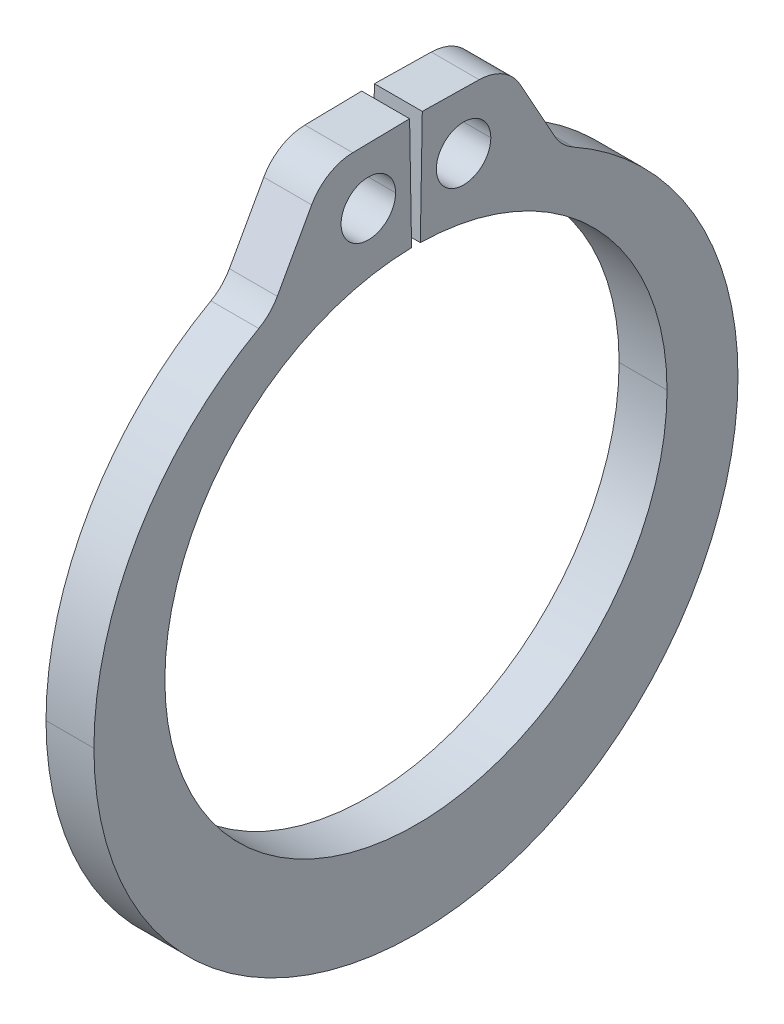
ISO-10303-21;
HEADER;
FILE_DESCRIPTION(('STEP AP214'),'2;1');
FILE_NAME('part.step','',(''),(''),'','','');
FILE_SCHEMA(('AUTOMOTIVE_DESIGN { 1 0 10303 214 1 1 1 1 }'));
ENDSEC;
DATA;
#1=APPLICATION_CONTEXT('core data for automotive mechanical design processes');
#2=APPLICATION_PROTOCOL_DEFINITION('international standard','automotive_design',2000,#1);
#3=PRODUCT_CONTEXT('',#1,'mechanical');
#4=PRODUCT('Part','Part','',(#3));
#5=PRODUCT_RELATED_PRODUCT_CATEGORY('part','',(#4));
#6=PRODUCT_DEFINITION_FORMATION('','',#4);
#7=PRODUCT_DEFINITION_CONTEXT('part definition',#1,'design');
#8=PRODUCT_DEFINITION('design','',#6,#7);
#9=PRODUCT_DEFINITION_SHAPE('','',#8);
#10=(LENGTH_UNIT() NAMED_UNIT(*) SI_UNIT(.MILLI.,.METRE.));
#11=(NAMED_UNIT(*) PLANE_ANGLE_UNIT() SI_UNIT($,.RADIAN.));
#12=(NAMED_UNIT(*) SI_UNIT($,.STERADIAN.) SOLID_ANGLE_UNIT());
#13=UNCERTAINTY_MEASURE_WITH_UNIT(LENGTH_MEASURE(1.E-05),#10,'distance_accuracy_value','');
#14=(GEOMETRIC_REPRESENTATION_CONTEXT(3) GLOBAL_UNCERTAINTY_ASSIGNED_CONTEXT((#13)) GLOBAL_UNIT_ASSIGNED_CONTEXT((#10,
#11,#12)) REPRESENTATION_CONTEXT('',''));
#15=CARTESIAN_POINT('',(0.,0.,0.));
#16=DIRECTION('',(0.,0.,1.));
#17=DIRECTION('',(1.,0.,0.));
#18=AXIS2_PLACEMENT_3D('',#15,#16,#17);
#19=CARTESIAN_POINT('',(0.97155,12.7720810042562,-2.53055334817983));
#20=DIRECTION('',(-1.,0.,0.));
#21=DIRECTION('',(0.,0.,1.));
#22=AXIS2_PLACEMENT_3D('',#19,#20,#21);
#23=CYLINDRICAL_SURFACE('',#22,1.9431);
#24=CARTESIAN_POINT('',(0.97155,12.7720810042562,-2.53055334817983));
#25=DIRECTION('',(1.,0.,0.));
#26=DIRECTION('',(0.,0.,-1.));
#27=AXIS2_PLACEMENT_3D('',#24,#25,#26);
#28=CIRCLE('',#27,1.9431);
#29=CARTESIAN_POINT('',(0.97155,13.7142637333689,-4.22994421403788));
#30=VERTEX_POINT('',#29);
#31=CARTESIAN_POINT('',(0.97155,14.7148850607146,-2.56446511912812));
#32=VERTEX_POINT('',#31);
#33=EDGE_CURVE('E279',#30,#32,#28,.T.);
#34=ORIENTED_EDGE('',*,*,#33,.F.);
#35=DIRECTION('',(1.,0.,0.));
#36=VECTOR('',#35,1.);
#37=CARTESIAN_POINT('',(0.97155,13.7142637333689,-4.22994421403788));
#38=LINE('',#37,#36);
#39=CARTESIAN_POINT('',(-0.97155,13.7142637333689,-4.22994421403788));
#40=VERTEX_POINT('',#39);
#41=EDGE_CURVE('E154',#40,#30,#38,.T.);
#42=ORIENTED_EDGE('',*,*,#41,.F.);
#43=CARTESIAN_POINT('',(-0.97155,12.7720810042562,-2.53055334817983));
#44=DIRECTION('',(-1.,0.,0.));
#45=DIRECTION('',(0.,0.,-1.));
#46=AXIS2_PLACEMENT_3D('',#43,#44,#45);
#47=CIRCLE('',#46,1.9431);
#48=CARTESIAN_POINT('',(-0.97155,14.7148850607146,-2.56446511912812));
#49=VERTEX_POINT('',#48);
#50=EDGE_CURVE('E300',#49,#40,#47,.T.);
#51=ORIENTED_EDGE('',*,*,#50,.F.);
#52=DIRECTION('',(-1.,0.,0.));
#53=VECTOR('',#52,1.);
#54=CARTESIAN_POINT('',(0.97155,14.7148850607146,-2.56446511912812));
#55=LINE('',#54,#53);
#56=EDGE_CURVE('E27',#32,#49,#55,.T.);
#57=ORIENTED_EDGE('',*,*,#56,.F.);
#58=EDGE_LOOP('',(#34,#42,#51,#57));
#59=FACE_BOUND('',#58,.T.);
#60=ADVANCED_FACE('F16',(#59),#23,.T.);
#61=CARTESIAN_POINT('',(0.97155,12.7720810042562,2.53055334817983));
#62=DIRECTION('',(-1.,0.,0.));
#63=DIRECTION('',(0.,0.,1.));
#64=AXIS2_PLACEMENT_3D('',#61,#62,#63);
#65=CYLINDRICAL_SURFACE('',#64,1.9431);
#66=CARTESIAN_POINT('',(0.97155,12.7720810042562,2.53055334817983));
#67=DIRECTION('',(1.,0.,0.));
#68=DIRECTION('',(0.,0.,-1.));
#69=AXIS2_PLACEMENT_3D('',#66,#67,#68);
#70=CIRCLE('',#69,1.9431);
#71=CARTESIAN_POINT('',(0.97155,14.7148850607146,2.56446511912812));
#72=VERTEX_POINT('',#71);
#73=CARTESIAN_POINT('',(0.97155,13.7142637333689,4.22994421403788));
#74=VERTEX_POINT('',#73);
#75=EDGE_CURVE('E20',#72,#74,#70,.T.);
#76=ORIENTED_EDGE('',*,*,#75,.F.);
#77=DIRECTION('',(1.,0.,0.));
#78=VECTOR('',#77,1.);
#79=CARTESIAN_POINT('',(0.97155,14.7148850607146,2.56446511912812));
#80=LINE('',#79,#78);
#81=CARTESIAN_POINT('',(-0.97155,14.7148850607146,2.56446511912812));
#82=VERTEX_POINT('',#81);
#83=EDGE_CURVE('E306',#82,#72,#80,.T.);
#84=ORIENTED_EDGE('',*,*,#83,.F.);
#85=CARTESIAN_POINT('',(-0.97155,12.7720810042562,2.53055334817983));
#86=DIRECTION('',(-1.,0.,0.));
#87=DIRECTION('',(0.,0.,-1.));
#88=AXIS2_PLACEMENT_3D('',#85,#86,#87);
#89=CIRCLE('',#88,1.9431);
#90=CARTESIAN_POINT('',(-0.97155,13.7142637333689,4.22994421403788));
#91=VERTEX_POINT('',#90);
#92=EDGE_CURVE('E261',#91,#82,#89,.T.);
#93=ORIENTED_EDGE('',*,*,#92,.F.);
#94=DIRECTION('',(-1.,0.,0.));
#95=VECTOR('',#94,1.);
#96=CARTESIAN_POINT('',(0.97155,13.7142637333689,4.22994421403788));
#97=LINE('',#96,#95);
#98=EDGE_CURVE('E305',#74,#91,#97,.T.);
#99=ORIENTED_EDGE('',*,*,#98,.F.);
#100=EDGE_LOOP('',(#76,#84,#93,#99));
#101=FACE_BOUND('',#100,.T.);
#102=ADVANCED_FACE('F446',(#101),#65,.T.);
#103=CARTESIAN_POINT('',(0.97155,12.1409614113131,-7.32397984242115));
#104=DIRECTION('',(-1.,0.,0.));
#105=DIRECTION('',(0.,0.,1.));
#106=AXIS2_PLACEMENT_3D('',#103,#104,#105);
#107=CYLINDRICAL_SURFACE('',#106,1.9431);
#108=CARTESIAN_POINT('',(0.97155,12.1409614113131,-7.32397984242115));
#109=DIRECTION('',(-1.,0.,0.));
#110=DIRECTION('',(0.,0.,-1.));
#111=AXIS2_PLACEMENT_3D('',#108,#109,#110);
#112=CIRCLE('',#111,1.9431);
#113=CARTESIAN_POINT('',(0.97155,10.4449894530748,-6.37565672930559));
#114=VERTEX_POINT('',#113);
#115=CARTESIAN_POINT('',(0.97155,11.1987786822004,-5.6245889765631));
#116=VERTEX_POINT('',#115);
#117=EDGE_CURVE('E372',#114,#116,#112,.T.);
#118=ORIENTED_EDGE('',*,*,#117,.F.);
#119=DIRECTION('',(1.,0.,0.));
#120=VECTOR('',#119,1.);
#121=CARTESIAN_POINT('',(0.97155,10.4449894530748,-6.37565672930559));
#122=LINE('',#121,#120);
#123=CARTESIAN_POINT('',(-0.97155,10.4449894530748,-6.37565672930559));
#124=VERTEX_POINT('',#123);
#125=EDGE_CURVE('E278',#124,#114,#122,.T.);
#126=ORIENTED_EDGE('',*,*,#125,.F.);
#127=CARTESIAN_POINT('',(-0.97155,12.1409614113131,-7.32397984242115));
#128=DIRECTION('',(1.,0.,0.));
#129=DIRECTION('',(0.,0.,-1.));
#130=AXIS2_PLACEMENT_3D('',#127,#128,#129);
#131=CIRCLE('',#130,1.9431);
#132=CARTESIAN_POINT('',(-0.97155,11.1987786822004,-5.6245889765631));
#133=VERTEX_POINT('',#132);
#134=EDGE_CURVE('E299',#133,#124,#131,.T.);
#135=ORIENTED_EDGE('',*,*,#134,.F.);
#136=DIRECTION('',(-1.,0.,0.));
#137=VECTOR('',#136,1.);
#138=CARTESIAN_POINT('',(-0.97155,11.1987786822004,-5.6245889765631));
#139=LINE('',#138,#137);
#140=EDGE_CURVE('E310',#116,#133,#139,.T.);
#141=ORIENTED_EDGE('',*,*,#140,.F.);
#142=EDGE_LOOP('',(#118,#126,#135,#141));
#143=FACE_BOUND('',#142,.T.);
#144=ADVANCED_FACE('F502',(#143),#107,.F.);
#145=CARTESIAN_POINT('',(0.97155,12.1409614113131,7.32397984242115));
#146=DIRECTION('',(-1.,0.,0.));
#147=DIRECTION('',(0.,0.,1.));
#148=AXIS2_PLACEMENT_3D('',#145,#146,#147);
#149=CYLINDRICAL_SURFACE('',#148,1.9431);
#150=CARTESIAN_POINT('',(0.97155,12.1409614113131,7.32397984242115));
#151=DIRECTION('',(-1.,0.,0.));
#152=DIRECTION('',(0.,0.,-1.));
#153=AXIS2_PLACEMENT_3D('',#150,#151,#152);
#154=CIRCLE('',#153,1.9431);
#155=CARTESIAN_POINT('',(0.97155,11.1987786822004,5.6245889765631));
#156=VERTEX_POINT('',#155);
#157=CARTESIAN_POINT('',(0.97155,10.4449894530748,6.37565672930559));
#158=VERTEX_POINT('',#157);
#159=EDGE_CURVE('E323',#156,#158,#154,.T.);
#160=ORIENTED_EDGE('',*,*,#159,.F.);
#161=DIRECTION('',(1.,0.,0.));
#162=VECTOR('',#161,1.);
#163=CARTESIAN_POINT('',(0.97155,11.1987786822004,5.6245889765631));
#164=LINE('',#163,#162);
#165=CARTESIAN_POINT('',(-0.97155,11.1987786822004,5.6245889765631));
#166=VERTEX_POINT('',#165);
#167=EDGE_CURVE('E302',#166,#156,#164,.T.);
#168=ORIENTED_EDGE('',*,*,#167,.F.);
#169=CARTESIAN_POINT('',(-0.97155,12.1409614113131,7.32397984242115));
#170=DIRECTION('',(1.,0.,0.));
#171=DIRECTION('',(0.,0.,-1.));
#172=AXIS2_PLACEMENT_3D('',#169,#170,#171);
#173=CIRCLE('',#172,1.9431);
#174=CARTESIAN_POINT('',(-0.97155,10.4449894530748,6.37565672930559));
#175=VERTEX_POINT('',#174);
#176=EDGE_CURVE('E351',#175,#166,#173,.T.);
#177=ORIENTED_EDGE('',*,*,#176,.F.);
#178=DIRECTION('',(-1.,0.,0.));
#179=VECTOR('',#178,1.);
#180=CARTESIAN_POINT('',(0.97155,10.4449894530748,6.37565672930559));
#181=LINE('',#180,#179);
#182=EDGE_CURVE('E42',#158,#175,#181,.T.);
#183=ORIENTED_EDGE('',*,*,#182,.F.);
#184=EDGE_LOOP('',(#160,#168,#177,#183));
#185=FACE_BOUND('',#184,.T.);
#186=ADVANCED_FACE('F524',(#185),#149,.F.);
#187=CARTESIAN_POINT('',(0.97155,12.4395783945367,-1.93189481498757));
#188=DIRECTION('',(-1.,0.,0.));
#189=DIRECTION('',(0.,0.,1.));
#190=AXIS2_PLACEMENT_3D('',#187,#188,#189);
#191=CYLINDRICAL_SURFACE('',#190,1.1049);
#192=DIRECTION('',(-1.,0.,0.));
#193=VECTOR('',#192,1.);
#194=CARTESIAN_POINT('',(0.97155,12.4395783945367,-3.03679481498757));
#195=LINE('',#194,#193);
#196=CARTESIAN_POINT('',(0.97155,12.4395783945367,-3.03679481498757));
#197=VERTEX_POINT('',#196);
#198=CARTESIAN_POINT('',(-0.97155,12.4395783945367,-3.03679481498757));
#199=VERTEX_POINT('',#198);
#200=EDGE_CURVE('E245',#197,#199,#195,.T.);
#201=ORIENTED_EDGE('',*,*,#200,.F.);
#202=CARTESIAN_POINT('',(0.97155,12.4395783945367,-1.93189481498757));
#203=DIRECTION('',(1.,0.,0.));
#204=DIRECTION('',(0.,0.,-1.));
#205=AXIS2_PLACEMENT_3D('',#202,#203,#204);
#206=CIRCLE('',#205,1.1049);
#207=CARTESIAN_POINT('',(0.97155,12.4395783945367,-0.826994814987568));
#208=VERTEX_POINT('',#207);
#209=EDGE_CURVE('E287',#197,#208,#206,.T.);
#210=ORIENTED_EDGE('',*,*,#209,.T.);
#211=DIRECTION('',(-1.,0.,0.));
#212=VECTOR('',#211,1.);
#213=CARTESIAN_POINT('',(0.97155,12.4395783945367,-0.826994814987568));
#214=LINE('',#213,#212);
#215=CARTESIAN_POINT('',(-0.97155,12.4395783945367,-0.826994814987568));
#216=VERTEX_POINT('',#215);
#217=EDGE_CURVE('E249',#208,#216,#214,.T.);
#218=ORIENTED_EDGE('',*,*,#217,.T.);
#219=CARTESIAN_POINT('',(-0.97155,12.4395783945367,-1.93189481498757));
#220=DIRECTION('',(1.,0.,0.));
#221=DIRECTION('',(0.,0.,-1.));
#222=AXIS2_PLACEMENT_3D('',#219,#220,#221);
#223=CIRCLE('',#222,1.1049);
#224=EDGE_CURVE('E325',#199,#216,#223,.T.);
#225=ORIENTED_EDGE('',*,*,#224,.F.);
#226=EDGE_LOOP('',(#201,#210,#218,#225));
#227=FACE_BOUND('',#226,.T.);
#228=ADVANCED_FACE('F474',(#227),#191,.F.);
#229=CARTESIAN_POINT('',(0.97155,12.4395783945367,1.93189481498757));
#230=DIRECTION('',(-1.,0.,0.));
#231=DIRECTION('',(0.,0.,1.));
#232=AXIS2_PLACEMENT_3D('',#229,#230,#231);
#233=CYLINDRICAL_SURFACE('',#232,1.1049);
#234=DIRECTION('',(-1.,0.,0.));
#235=VECTOR('',#234,1.);
#236=CARTESIAN_POINT('',(0.97155,12.4395783945367,0.826994814987568));
#237=LINE('',#236,#235);
#238=CARTESIAN_POINT('',(0.97155,12.4395783945367,0.826994814987568));
#239=VERTEX_POINT('',#238);
#240=CARTESIAN_POINT('',(-0.97155,12.4395783945367,0.826994814987568));
#241=VERTEX_POINT('',#240);
#242=EDGE_CURVE('E293',#239,#241,#237,.T.);
#243=ORIENTED_EDGE('',*,*,#242,.F.);
#244=CARTESIAN_POINT('',(0.97155,12.4395783945367,1.93189481498757));
#245=DIRECTION('',(1.,0.,0.));
#246=DIRECTION('',(0.,0.,-1.));
#247=AXIS2_PLACEMENT_3D('',#244,#245,#246);
#248=CIRCLE('',#247,1.1049);
#249=CARTESIAN_POINT('',(0.97155,12.4395783945367,3.03679481498757));
#250=VERTEX_POINT('',#249);
#251=EDGE_CURVE('E313',#239,#250,#248,.T.);
#252=ORIENTED_EDGE('',*,*,#251,.T.);
#253=DIRECTION('',(-1.,0.,0.));
#254=VECTOR('',#253,1.);
#255=CARTESIAN_POINT('',(0.97155,12.4395783945367,3.03679481498757));
#256=LINE('',#255,#254);
#257=CARTESIAN_POINT('',(-0.97155,12.4395783945367,3.03679481498757));
#258=VERTEX_POINT('',#257);
#259=EDGE_CURVE('E292',#250,#258,#256,.T.);
#260=ORIENTED_EDGE('',*,*,#259,.T.);
#261=CARTESIAN_POINT('',(-0.97155,12.4395783945367,1.93189481498757));
#262=DIRECTION('',(1.,0.,0.));
#263=DIRECTION('',(0.,0.,-1.));
#264=AXIS2_PLACEMENT_3D('',#261,#262,#263);
#265=CIRCLE('',#264,1.1049);
#266=EDGE_CURVE('E329',#241,#258,#265,.T.);
#267=ORIENTED_EDGE('',*,*,#266,.F.);
#268=EDGE_LOOP('',(#243,#252,#260,#267));
#269=FACE_BOUND('',#268,.T.);
#270=ADVANCED_FACE('F490',(#269),#233,.F.);
#271=CARTESIAN_POINT('',(0.97155,10.1838487142459,-0.177759740526307));
#272=DIRECTION('',(0.,-0.0174524064372833,-0.999847695156391));
#273=DIRECTION('',(0.,-0.999847695156391,0.0174524064372833));
#274=AXIS2_PLACEMENT_3D('',#271,#272,#273);
#275=PLANE('',#274);
#276=DIRECTION('',(0.,-0.999847695156391,0.0174524064372833));
#277=VECTOR('',#276,1.);
#278=CARTESIAN_POINT('',(-0.97155,10.1838487142459,-0.177759740526307));
#279=LINE('',#278,#277);
#280=CARTESIAN_POINT('',(-0.97155,14.7551523765009,-0.257552142757566));
#281=VERTEX_POINT('',#280);
#282=CARTESIAN_POINT('',(-0.97155,10.1838487142459,-0.177759740526307));
#283=VERTEX_POINT('',#282);
#284=EDGE_CURVE('E270',#281,#283,#279,.T.);
#285=ORIENTED_EDGE('',*,*,#284,.T.);
#286=DIRECTION('',(-1.,0.,0.));
#287=VECTOR('',#286,1.);
#288=CARTESIAN_POINT('',(0.97155,10.1838487142459,-0.177759740526307));
#289=LINE('',#288,#287);
#290=CARTESIAN_POINT('',(0.97155,10.1838487142459,-0.177759740526307));
#291=VERTEX_POINT('',#290);
#292=EDGE_CURVE('E328',#291,#283,#289,.T.);
#293=ORIENTED_EDGE('',*,*,#292,.F.);
#294=DIRECTION('',(0.,-0.999847695156391,0.0174524064372833));
#295=VECTOR('',#294,1.);
#296=CARTESIAN_POINT('',(0.97155,10.1838487142459,-0.177759740526307));
#297=LINE('',#296,#295);
#298=CARTESIAN_POINT('',(0.97155,14.7551523765009,-0.257552142757566));
#299=VERTEX_POINT('',#298);
#300=EDGE_CURVE('E253',#299,#291,#297,.T.);
#301=ORIENTED_EDGE('',*,*,#300,.F.);
#302=DIRECTION('',(-1.,0.,0.));
#303=VECTOR('',#302,1.);
#304=CARTESIAN_POINT('',(0.97155,14.7551523765009,-0.257552142757566));
#305=LINE('',#304,#303);
#306=EDGE_CURVE('E11',#299,#281,#305,.T.);
#307=ORIENTED_EDGE('',*,*,#306,.T.);
#308=EDGE_LOOP('',(#285,#293,#301,#307));
#309=FACE_BOUND('',#308,.T.);
#310=ADVANCED_FACE('F523',(#309),#275,.F.);
#311=CARTESIAN_POINT('',(0.97155,14.7551523765009,-0.257552142757566));
#312=DIRECTION('',(0.,-0.999847695156391,0.0174524064372834));
#313=DIRECTION('',(-1.,0.,0.));
#314=AXIS2_PLACEMENT_3D('',#311,#312,#313);
#315=PLANE('',#314);
#316=DIRECTION('',(0.,0.0174524064372834,0.999847695156391));
#317=VECTOR('',#316,1.);
#318=CARTESIAN_POINT('',(0.97155,14.7551523765009,-0.257552142757566));
#319=LINE('',#318,#317);
#320=EDGE_CURVE('E258',#32,#299,#319,.T.);
#321=ORIENTED_EDGE('',*,*,#320,.F.);
#322=ORIENTED_EDGE('',*,*,#56,.T.);
#323=DIRECTION('',(0.,0.0174524064372834,0.999847695156391));
#324=VECTOR('',#323,1.);
#325=CARTESIAN_POINT('',(-0.97155,14.7551523765009,-0.257552142757566));
#326=LINE('',#325,#324);
#327=EDGE_CURVE('E274',#49,#281,#326,.T.);
#328=ORIENTED_EDGE('',*,*,#327,.T.);
#329=ORIENTED_EDGE('',*,*,#306,.F.);
#330=EDGE_LOOP('',(#321,#322,#328,#329));
#331=FACE_BOUND('',#330,.T.);
#332=ADVANCED_FACE('F418',(#331),#315,.F.);
#333=CARTESIAN_POINT('',(0.97155,14.6953080748275,-3.68602988944883));
#334=DIRECTION('',(0.,-0.484886382127883,0.874577152929879));
#335=DIRECTION('',(-1.,0.,0.));
#336=AXIS2_PLACEMENT_3D('',#333,#334,#335);
#337=PLANE('',#336);
#338=DIRECTION('',(0.,0.874577152929879,0.484886382127883));
#339=VECTOR('',#338,1.);
#340=CARTESIAN_POINT('',(0.97155,14.6953080748275,-3.68602988944883));
#341=LINE('',#340,#339);
#342=EDGE_CURVE('E283',#116,#30,#341,.T.);
#343=ORIENTED_EDGE('',*,*,#342,.F.);
#344=ORIENTED_EDGE('',*,*,#140,.T.);
#345=DIRECTION('',(0.,0.874577152929879,0.484886382127883));
#346=VECTOR('',#345,1.);
#347=CARTESIAN_POINT('',(-0.97155,14.6953080748275,-3.68602988944883));
#348=LINE('',#347,#346);
#349=EDGE_CURVE('E297',#133,#40,#348,.T.);
#350=ORIENTED_EDGE('',*,*,#349,.T.);
#351=ORIENTED_EDGE('',*,*,#41,.T.);
#352=EDGE_LOOP('',(#343,#344,#350,#351));
#353=FACE_BOUND('',#352,.T.);
#354=ADVANCED_FACE('F422',(#353),#337,.F.);
#355=CARTESIAN_POINT('',(0.97155,-0.957173879981445,0.));
#356=DIRECTION('',(-1.,0.,0.));
#357=DIRECTION('',(0.,0.,1.));
#358=AXIS2_PLACEMENT_3D('',#355,#356,#357);
#359=CYLINDRICAL_SURFACE('',#358,13.0636261200186);
#360=DIRECTION('',(-1.,0.,0.));
#361=VECTOR('',#360,1.);
#362=CARTESIAN_POINT('',(0.97155,-0.957173879981445,13.0636261200186));
#363=LINE('',#362,#361);
#364=CARTESIAN_POINT('',(0.97155,-0.957173879981445,13.0636261200186));
#365=VERTEX_POINT('',#364);
#366=CARTESIAN_POINT('',(-0.97155,-0.957173879981445,13.0636261200186));
#367=VERTEX_POINT('',#366);
#368=EDGE_CURVE('E240',#365,#367,#363,.T.);
#369=ORIENTED_EDGE('',*,*,#368,.F.);
#370=CARTESIAN_POINT('',(0.97155,-0.957173879981445,0.));
#371=DIRECTION('',(1.,0.,0.));
#372=DIRECTION('',(0.,0.,-1.));
#373=AXIS2_PLACEMENT_3D('',#370,#371,#372);
#374=CIRCLE('',#373,13.0636261200186);
#375=EDGE_CURVE('E341',#158,#365,#374,.T.);
#376=ORIENTED_EDGE('',*,*,#375,.F.);
#377=ORIENTED_EDGE('',*,*,#182,.T.);
#378=CARTESIAN_POINT('',(-0.97155,-0.957173879981445,0.));
#379=DIRECTION('',(1.,0.,0.));
#380=DIRECTION('',(0.,0.,-1.));
#381=AXIS2_PLACEMENT_3D('',#378,#379,#380);
#382=CIRCLE('',#381,13.0636261200186);
#383=EDGE_CURVE('E236',#175,#367,#382,.T.);
#384=ORIENTED_EDGE('',*,*,#383,.T.);
#385=EDGE_LOOP('',(#369,#376,#377,#384));
#386=FACE_BOUND('',#385,.T.);
#387=ADVANCED_FACE('F505',(#386),#359,.T.);
#388=CARTESIAN_POINT('',(0.97155,14.6953080748275,3.68602988944883));
#389=DIRECTION('',(0.,-0.484886382127883,-0.874577152929879));
#390=DIRECTION('',(0.,-0.874577152929879,0.484886382127883));
#391=AXIS2_PLACEMENT_3D('',#388,#389,#390);
#392=PLANE('',#391);
#393=DIRECTION('',(0.,-0.874577152929879,0.484886382127883));
#394=VECTOR('',#393,1.);
#395=CARTESIAN_POINT('',(-0.97155,14.6953080748275,3.68602988944883));
#396=LINE('',#395,#394);
#397=EDGE_CURVE('E266',#91,#166,#396,.T.);
#398=ORIENTED_EDGE('',*,*,#397,.T.);
#399=ORIENTED_EDGE('',*,*,#167,.T.);
#400=DIRECTION('',(0.,-0.874577152929879,0.484886382127883));
#401=VECTOR('',#400,1.);
#402=CARTESIAN_POINT('',(0.97155,14.6953080748275,3.68602988944883));
#403=LINE('',#402,#401);
#404=EDGE_CURVE('E320',#74,#156,#403,.T.);
#405=ORIENTED_EDGE('',*,*,#404,.F.);
#406=ORIENTED_EDGE('',*,*,#98,.T.);
#407=EDGE_LOOP('',(#398,#399,#405,#406));
#408=FACE_BOUND('',#407,.T.);
#409=ADVANCED_FACE('F510',(#408),#392,.F.);
#410=CARTESIAN_POINT('',(0.97155,14.7551523765009,0.257552142757566));
#411=DIRECTION('',(0.,-0.999847695156391,-0.0174524064372834));
#412=DIRECTION('',(0.,0.0174524064372834,-0.999847695156391));
#413=AXIS2_PLACEMENT_3D('',#410,#411,#412);
#414=PLANE('',#413);
#415=DIRECTION('',(0.,-0.0174524064372834,0.999847695156391));
#416=VECTOR('',#415,1.);
#417=CARTESIAN_POINT('',(-0.97155,14.7551523765009,0.257552142757566));
#418=LINE('',#417,#416);
#419=CARTESIAN_POINT('',(-0.97155,14.7551523765009,0.257552142757566));
#420=VERTEX_POINT('',#419);
#421=EDGE_CURVE('E265',#420,#82,#418,.T.);
#422=ORIENTED_EDGE('',*,*,#421,.T.);
#423=ORIENTED_EDGE('',*,*,#83,.T.);
#424=DIRECTION('',(0.,-0.0174524064372834,0.999847695156391));
#425=VECTOR('',#424,1.);
#426=CARTESIAN_POINT('',(0.97155,14.7551523765009,0.257552142757566));
#427=LINE('',#426,#425);
#428=CARTESIAN_POINT('',(0.97155,14.7551523765009,0.257552142757566));
#429=VERTEX_POINT('',#428);
#430=EDGE_CURVE('E359',#429,#72,#427,.T.);
#431=ORIENTED_EDGE('',*,*,#430,.F.);
#432=DIRECTION('',(-1.,0.,0.));
#433=VECTOR('',#432,1.);
#434=CARTESIAN_POINT('',(0.97155,14.7551523765009,0.257552142757566));
#435=LINE('',#434,#433);
#436=EDGE_CURVE('E335',#429,#420,#435,.T.);
#437=ORIENTED_EDGE('',*,*,#436,.T.);
#438=EDGE_LOOP('',(#422,#423,#431,#437));
#439=FACE_BOUND('',#438,.T.);
#440=ADVANCED_FACE('F440',(#439),#414,.F.);
#441=CARTESIAN_POINT('',(0.97155,10.1838487142459,0.177759740526307));
#442=DIRECTION('',(0.,-0.0174524064372833,0.999847695156391));
#443=DIRECTION('',(-1.,0.,0.));
#444=AXIS2_PLACEMENT_3D('',#441,#442,#443);
#445=PLANE('',#444);
#446=DIRECTION('',(0.,0.999847695156391,0.0174524064372833));
#447=VECTOR('',#446,1.);
#448=CARTESIAN_POINT('',(-0.97155,10.1838487142459,0.177759740526307));
#449=LINE('',#448,#447);
#450=CARTESIAN_POINT('',(-0.97155,10.1838487142459,0.177759740526307));
#451=VERTEX_POINT('',#450);
#452=EDGE_CURVE('E206',#451,#420,#449,.T.);
#453=ORIENTED_EDGE('',*,*,#452,.T.);
#454=ORIENTED_EDGE('',*,*,#436,.F.);
#455=DIRECTION('',(0.,0.999847695156391,0.0174524064372833));
#456=VECTOR('',#455,1.);
#457=CARTESIAN_POINT('',(0.97155,10.1838487142459,0.177759740526307));
#458=LINE('',#457,#456);
#459=CARTESIAN_POINT('',(0.97155,10.1838487142459,0.177759740526307));
#460=VERTEX_POINT('',#459);
#461=EDGE_CURVE('E186',#460,#429,#458,.T.);
#462=ORIENTED_EDGE('',*,*,#461,.F.);
#463=DIRECTION('',(-1.,0.,0.));
#464=VECTOR('',#463,1.);
#465=CARTESIAN_POINT('',(0.97155,10.1838487142459,0.177759740526307));
#466=LINE('',#465,#464);
#467=EDGE_CURVE('E209',#460,#451,#466,.T.);
#468=ORIENTED_EDGE('',*,*,#467,.T.);
#469=EDGE_LOOP('',(#453,#454,#462,#468));
#470=FACE_BOUND('',#469,.T.);
#471=ADVANCED_FACE('F509',(#470),#445,.F.);
#472=CARTESIAN_POINT('',(0.97155,0.,0.));
#473=DIRECTION('',(-1.,0.,0.));
#474=DIRECTION('',(0.,0.,1.));
#475=AXIS2_PLACEMENT_3D('',#472,#473,#474);
#476=CYLINDRICAL_SURFACE('',#475,10.1854);
#477=DIRECTION('',(-1.,0.,0.));
#478=VECTOR('',#477,1.);
#479=CARTESIAN_POINT('',(0.97155,0.,-10.1854));
#480=LINE('',#479,#478);
#481=CARTESIAN_POINT('',(0.97155,0.,-10.1854));
#482=VERTEX_POINT('',#481);
#483=CARTESIAN_POINT('',(-0.97155,0.,-10.1854));
#484=VERTEX_POINT('',#483);
#485=EDGE_CURVE('E224',#482,#484,#480,.T.);
#486=ORIENTED_EDGE('',*,*,#485,.F.);
#487=CARTESIAN_POINT('',(0.97155,0.,0.));
#488=DIRECTION('',(-1.,0.,0.));
#489=DIRECTION('',(0.,0.,-1.));
#490=AXIS2_PLACEMENT_3D('',#487,#488,#489);
#491=CIRCLE('',#490,10.1854);
#492=EDGE_CURVE('E257',#291,#482,#491,.T.);
#493=ORIENTED_EDGE('',*,*,#492,.F.);
#494=ORIENTED_EDGE('',*,*,#292,.T.);
#495=CARTESIAN_POINT('',(-0.97155,0.,0.));
#496=DIRECTION('',(-1.,0.,0.));
#497=DIRECTION('',(0.,0.,-1.));
#498=AXIS2_PLACEMENT_3D('',#495,#496,#497);
#499=CIRCLE('',#498,10.1854);
#500=EDGE_CURVE('E267',#283,#484,#499,.T.);
#501=ORIENTED_EDGE('',*,*,#500,.T.);
#502=EDGE_LOOP('',(#486,#493,#494,#501));
#503=FACE_BOUND('',#502,.T.);
#504=ADVANCED_FACE('F481',(#503),#476,.F.);
#505=CARTESIAN_POINT('',(-0.97155,0.,0.));
#506=DIRECTION('',(1.,0.,0.));
#507=DIRECTION('',(0.,1.,0.));
#508=AXIS2_PLACEMENT_3D('',#505,#506,#507);
#509=PLANE('',#508);
#510=CARTESIAN_POINT('',(-0.97155,12.4395783945367,-1.93189481498757));
#511=DIRECTION('',(1.,0.,0.));
#512=DIRECTION('',(0.,0.,-1.));
#513=AXIS2_PLACEMENT_3D('',#510,#511,#512);
#514=CIRCLE('',#513,1.1049);
#515=EDGE_CURVE('E246',#216,#199,#514,.T.);
#516=ORIENTED_EDGE('',*,*,#515,.T.);
#517=ORIENTED_EDGE('',*,*,#224,.T.);
#518=EDGE_LOOP('',(#516,#517));
#519=FACE_BOUND('',#518,.T.);
#520=CARTESIAN_POINT('',(-0.97155,12.4395783945367,1.93189481498757));
#521=DIRECTION('',(1.,0.,0.));
#522=DIRECTION('',(0.,0.,-1.));
#523=AXIS2_PLACEMENT_3D('',#520,#521,#522);
#524=CIRCLE('',#523,1.1049);
#525=EDGE_CURVE('E288',#258,#241,#524,.T.);
#526=ORIENTED_EDGE('',*,*,#525,.T.);
#527=ORIENTED_EDGE('',*,*,#266,.T.);
#528=EDGE_LOOP('',(#526,#527));
#529=FACE_BOUND('',#528,.T.);
#530=ORIENTED_EDGE('',*,*,#397,.F.);
#531=ORIENTED_EDGE('',*,*,#92,.T.);
#532=ORIENTED_EDGE('',*,*,#421,.F.);
#533=ORIENTED_EDGE('',*,*,#452,.F.);
#534=CARTESIAN_POINT('',(-0.97155,0.,0.));
#535=DIRECTION('',(-1.,0.,0.));
#536=DIRECTION('',(0.,0.,-1.));
#537=AXIS2_PLACEMENT_3D('',#534,#535,#536);
#538=CIRCLE('',#537,10.1854);
#539=CARTESIAN_POINT('',(-0.97155,0.,10.1854));
#540=VERTEX_POINT('',#539);
#541=EDGE_CURVE('E196',#540,#451,#538,.T.);
#542=ORIENTED_EDGE('',*,*,#541,.F.);
#543=CARTESIAN_POINT('',(-0.97155,0.,0.));
#544=DIRECTION('',(-1.,0.,0.));
#545=DIRECTION('',(0.,0.,-1.));
#546=AXIS2_PLACEMENT_3D('',#543,#544,#545);
#547=CIRCLE('',#546,10.1854);
#548=EDGE_CURVE('E202',#484,#540,#547,.T.);
#549=ORIENTED_EDGE('',*,*,#548,.F.);
#550=ORIENTED_EDGE('',*,*,#500,.F.);
#551=ORIENTED_EDGE('',*,*,#284,.F.);
#552=ORIENTED_EDGE('',*,*,#327,.F.);
#553=ORIENTED_EDGE('',*,*,#50,.T.);
#554=ORIENTED_EDGE('',*,*,#349,.F.);
#555=ORIENTED_EDGE('',*,*,#134,.T.);
#556=CARTESIAN_POINT('',(-0.97155,-0.957173879981445,0.));
#557=DIRECTION('',(1.,0.,0.));
#558=DIRECTION('',(0.,0.,-1.));
#559=AXIS2_PLACEMENT_3D('',#556,#557,#558);
#560=CIRCLE('',#559,13.0636261200186);
#561=CARTESIAN_POINT('',(-0.97155,-0.957173879981443,-13.0636261200186));
#562=VERTEX_POINT('',#561);
#563=EDGE_CURVE('E330',#562,#124,#560,.T.);
#564=ORIENTED_EDGE('',*,*,#563,.F.);
#565=CARTESIAN_POINT('',(-0.97155,-0.957173879981445,0.));
#566=DIRECTION('',(1.,0.,0.));
#567=DIRECTION('',(0.,0.,-1.));
#568=AXIS2_PLACEMENT_3D('',#565,#566,#567);
#569=CIRCLE('',#568,13.0636261200186);
#570=EDGE_CURVE('E238',#367,#562,#569,.T.);
#571=ORIENTED_EDGE('',*,*,#570,.F.);
#572=ORIENTED_EDGE('',*,*,#383,.F.);
#573=ORIENTED_EDGE('',*,*,#176,.T.);
#574=EDGE_LOOP('',(#530,#531,#532,#533,#542,#549,#550,#551,#552,#553,#554,#555,#564,#571,#572,#573));
#575=FACE_BOUND('',#574,.T.);
#576=ADVANCED_FACE('F199',(#519,#529,#575),#509,.F.);
#577=CARTESIAN_POINT('',(0.97155,0.,0.));
#578=DIRECTION('',(1.,0.,0.));
#579=DIRECTION('',(0.,1.,0.));
#580=AXIS2_PLACEMENT_3D('',#577,#578,#579);
#581=PLANE('',#580);
#582=CARTESIAN_POINT('',(0.97155,12.4395783945367,-1.93189481498757));
#583=DIRECTION('',(1.,0.,0.));
#584=DIRECTION('',(0.,0.,-1.));
#585=AXIS2_PLACEMENT_3D('',#582,#583,#584);
#586=CIRCLE('',#585,1.1049);
#587=EDGE_CURVE('E241',#208,#197,#586,.T.);
#588=ORIENTED_EDGE('',*,*,#587,.F.);
#589=ORIENTED_EDGE('',*,*,#209,.F.);
#590=EDGE_LOOP('',(#588,#589));
#591=FACE_BOUND('',#590,.T.);
#592=CARTESIAN_POINT('',(0.97155,12.4395783945367,1.93189481498757));
#593=DIRECTION('',(1.,0.,0.));
#594=DIRECTION('',(0.,0.,-1.));
#595=AXIS2_PLACEMENT_3D('',#592,#593,#594);
#596=CIRCLE('',#595,1.1049);
#597=EDGE_CURVE('E369',#250,#239,#596,.T.);
#598=ORIENTED_EDGE('',*,*,#597,.F.);
#599=ORIENTED_EDGE('',*,*,#251,.F.);
#600=EDGE_LOOP('',(#598,#599));
#601=FACE_BOUND('',#600,.T.);
#602=ORIENTED_EDGE('',*,*,#430,.T.);
#603=ORIENTED_EDGE('',*,*,#75,.T.);
#604=ORIENTED_EDGE('',*,*,#404,.T.);
#605=ORIENTED_EDGE('',*,*,#159,.T.);
#606=ORIENTED_EDGE('',*,*,#375,.T.);
#607=CARTESIAN_POINT('',(0.97155,-0.957173879981445,0.));
#608=DIRECTION('',(1.,0.,0.));
#609=DIRECTION('',(0.,0.,-1.));
#610=AXIS2_PLACEMENT_3D('',#607,#608,#609);
#611=CIRCLE('',#610,13.0636261200186);
#612=CARTESIAN_POINT('',(0.97155,-0.957173879981443,-13.0636261200186));
#613=VERTEX_POINT('',#612);
#614=EDGE_CURVE('E275',#365,#613,#611,.T.);
#615=ORIENTED_EDGE('',*,*,#614,.T.);
#616=CARTESIAN_POINT('',(0.97155,-0.957173879981445,0.));
#617=DIRECTION('',(1.,0.,0.));
#618=DIRECTION('',(0.,0.,-1.));
#619=AXIS2_PLACEMENT_3D('',#616,#617,#618);
#620=CIRCLE('',#619,13.0636261200186);
#621=EDGE_CURVE('E348',#613,#114,#620,.T.);
#622=ORIENTED_EDGE('',*,*,#621,.T.);
#623=ORIENTED_EDGE('',*,*,#117,.T.);
#624=ORIENTED_EDGE('',*,*,#342,.T.);
#625=ORIENTED_EDGE('',*,*,#33,.T.);
#626=ORIENTED_EDGE('',*,*,#320,.T.);
#627=ORIENTED_EDGE('',*,*,#300,.T.);
#628=ORIENTED_EDGE('',*,*,#492,.T.);
#629=CARTESIAN_POINT('',(0.97155,0.,0.));
#630=DIRECTION('',(-1.,0.,0.));
#631=DIRECTION('',(0.,0.,-1.));
#632=AXIS2_PLACEMENT_3D('',#629,#630,#631);
#633=CIRCLE('',#632,10.1854);
#634=CARTESIAN_POINT('',(0.97155,0.,10.1854));
#635=VERTEX_POINT('',#634);
#636=EDGE_CURVE('E232',#482,#635,#633,.T.);
#637=ORIENTED_EDGE('',*,*,#636,.T.);
#638=CARTESIAN_POINT('',(0.97155,0.,0.));
#639=DIRECTION('',(-1.,0.,0.));
#640=DIRECTION('',(0.,0.,-1.));
#641=AXIS2_PLACEMENT_3D('',#638,#639,#640);
#642=CIRCLE('',#641,10.1854);
#643=EDGE_CURVE('E210',#635,#460,#642,.T.);
#644=ORIENTED_EDGE('',*,*,#643,.T.);
#645=ORIENTED_EDGE('',*,*,#461,.T.);
#646=EDGE_LOOP('',(#602,#603,#604,#605,#606,#615,#622,#623,#624,#625,#626,#627,#628,#637,#644,#645));
#647=FACE_BOUND('',#646,.T.);
#648=ADVANCED_FACE('F18',(#591,#601,#647),#581,.T.);
#649=CARTESIAN_POINT('',(0.97155,0.,0.));
#650=DIRECTION('',(-1.,0.,0.));
#651=DIRECTION('',(0.,0.,1.));
#652=AXIS2_PLACEMENT_3D('',#649,#650,#651);
#653=CYLINDRICAL_SURFACE('',#652,10.1854);
#654=ORIENTED_EDGE('',*,*,#643,.F.);
#655=DIRECTION('',(-1.,0.,0.));
#656=VECTOR('',#655,1.);
#657=CARTESIAN_POINT('',(0.97155,0.,10.1854));
#658=LINE('',#657,#656);
#659=EDGE_CURVE('E214',#635,#540,#658,.T.);
#660=ORIENTED_EDGE('',*,*,#659,.T.);
#661=ORIENTED_EDGE('',*,*,#541,.T.);
#662=ORIENTED_EDGE('',*,*,#467,.F.);
#663=EDGE_LOOP('',(#654,#660,#661,#662));
#664=FACE_BOUND('',#663,.T.);
#665=ADVANCED_FACE('F215',(#664),#653,.F.);
#666=CARTESIAN_POINT('',(0.97155,0.,0.));
#667=DIRECTION('',(-1.,0.,0.));
#668=DIRECTION('',(0.,0.,1.));
#669=AXIS2_PLACEMENT_3D('',#666,#667,#668);
#670=CYLINDRICAL_SURFACE('',#669,10.1854);
#671=ORIENTED_EDGE('',*,*,#636,.F.);
#672=ORIENTED_EDGE('',*,*,#485,.T.);
#673=ORIENTED_EDGE('',*,*,#548,.T.);
#674=ORIENTED_EDGE('',*,*,#659,.F.);
#675=EDGE_LOOP('',(#671,#672,#673,#674));
#676=FACE_BOUND('',#675,.T.);
#677=ADVANCED_FACE('F222',(#676),#670,.F.);
#678=CARTESIAN_POINT('',(0.97155,-0.957173879981445,0.));
#679=DIRECTION('',(-1.,0.,0.));
#680=DIRECTION('',(0.,0.,1.));
#681=AXIS2_PLACEMENT_3D('',#678,#679,#680);
#682=CYLINDRICAL_SURFACE('',#681,13.0636261200186);
#683=DIRECTION('',(-1.,0.,0.));
#684=VECTOR('',#683,1.);
#685=CARTESIAN_POINT('',(0.97155,-0.957173879981443,-13.0636261200186));
#686=LINE('',#685,#684);
#687=EDGE_CURVE('E334',#613,#562,#686,.T.);
#688=ORIENTED_EDGE('',*,*,#687,.F.);
#689=ORIENTED_EDGE('',*,*,#614,.F.);
#690=ORIENTED_EDGE('',*,*,#368,.T.);
#691=ORIENTED_EDGE('',*,*,#570,.T.);
#692=EDGE_LOOP('',(#688,#689,#690,#691));
#693=FACE_BOUND('',#692,.T.);
#694=ADVANCED_FACE('F519',(#693),#682,.T.);
#695=CARTESIAN_POINT('',(0.97155,-0.957173879981445,0.));
#696=DIRECTION('',(-1.,0.,0.));
#697=DIRECTION('',(0.,0.,1.));
#698=AXIS2_PLACEMENT_3D('',#695,#696,#697);
#699=CYLINDRICAL_SURFACE('',#698,13.0636261200186);
#700=ORIENTED_EDGE('',*,*,#621,.F.);
#701=ORIENTED_EDGE('',*,*,#687,.T.);
#702=ORIENTED_EDGE('',*,*,#563,.T.);
#703=ORIENTED_EDGE('',*,*,#125,.T.);
#704=EDGE_LOOP('',(#700,#701,#702,#703));
#705=FACE_BOUND('',#704,.T.);
#706=ADVANCED_FACE('F516',(#705),#699,.T.);
#707=CARTESIAN_POINT('',(0.97155,12.4395783945367,1.93189481498757));
#708=DIRECTION('',(-1.,0.,0.));
#709=DIRECTION('',(0.,0.,1.));
#710=AXIS2_PLACEMENT_3D('',#707,#708,#709);
#711=CYLINDRICAL_SURFACE('',#710,1.1049);
#712=ORIENTED_EDGE('',*,*,#597,.T.);
#713=ORIENTED_EDGE('',*,*,#242,.T.);
#714=ORIENTED_EDGE('',*,*,#525,.F.);
#715=ORIENTED_EDGE('',*,*,#259,.F.);
#716=EDGE_LOOP('',(#712,#713,#714,#715));
#717=FACE_BOUND('',#716,.T.);
#718=ADVANCED_FACE('F487',(#717),#711,.F.);
#719=CARTESIAN_POINT('',(0.97155,12.4395783945367,-1.93189481498757));
#720=DIRECTION('',(-1.,0.,0.));
#721=DIRECTION('',(0.,0.,1.));
#722=AXIS2_PLACEMENT_3D('',#719,#720,#721);
#723=CYLINDRICAL_SURFACE('',#722,1.1049);
#724=ORIENTED_EDGE('',*,*,#587,.T.);
#725=ORIENTED_EDGE('',*,*,#200,.T.);
#726=ORIENTED_EDGE('',*,*,#515,.F.);
#727=ORIENTED_EDGE('',*,*,#217,.F.);
#728=EDGE_LOOP('',(#724,#725,#726,#727));
#729=FACE_BOUND('',#728,.T.);
#730=ADVANCED_FACE('F477',(#729),#723,.F.);
#731=CLOSED_SHELL('',(#60,#102,#144,#186,#228,#270,#310,#332,#354,#387,#409,#440,#471,#504,#576,
#648,#665,#677,#694,#706,#718,#730));
#732=MANIFOLD_SOLID_BREP('B1',#731);
#733=ADVANCED_BREP_SHAPE_REPRESENTATION('',(#18,#732),#14);
#734=SHAPE_DEFINITION_REPRESENTATION(#9,#733);
ENDSEC;
END-ISO-10303-21;
